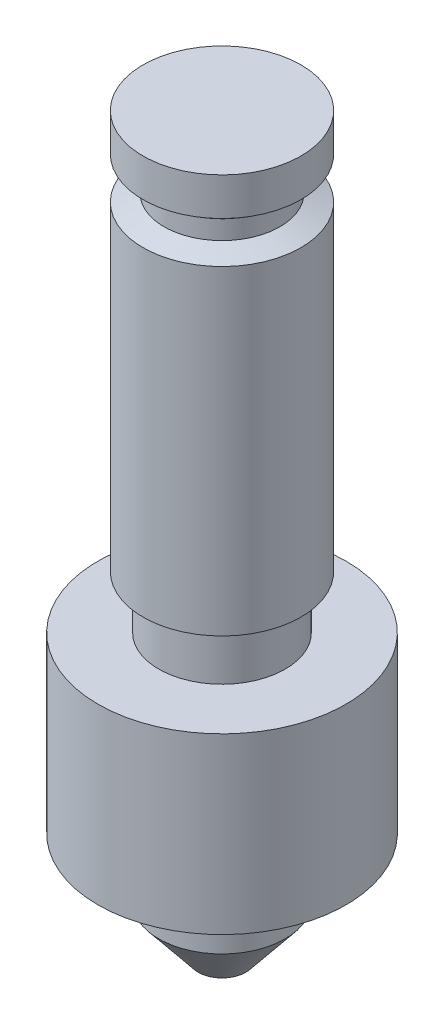
ISO-10303-21;
HEADER;
FILE_DESCRIPTION(('STEP AP214'),'2;1');
FILE_NAME('part.step','',(''),(''),'','','');
FILE_SCHEMA(('AUTOMOTIVE_DESIGN { 1 0 10303 214 1 1 1 1 }'));
ENDSEC;
DATA;
#1=APPLICATION_CONTEXT('core data for automotive mechanical design processes');
#2=APPLICATION_PROTOCOL_DEFINITION('international standard','automotive_design',2000,#1);
#3=PRODUCT_CONTEXT('',#1,'mechanical');
#4=PRODUCT('Part','Part','',(#3));
#5=PRODUCT_RELATED_PRODUCT_CATEGORY('part','',(#4));
#6=PRODUCT_DEFINITION_FORMATION('','',#4);
#7=PRODUCT_DEFINITION_CONTEXT('part definition',#1,'design');
#8=PRODUCT_DEFINITION('design','',#6,#7);
#9=PRODUCT_DEFINITION_SHAPE('','',#8);
#10=(LENGTH_UNIT() NAMED_UNIT(*) SI_UNIT(.MILLI.,.METRE.));
#11=(NAMED_UNIT(*) PLANE_ANGLE_UNIT() SI_UNIT($,.RADIAN.));
#12=(NAMED_UNIT(*) SI_UNIT($,.STERADIAN.) SOLID_ANGLE_UNIT());
#13=UNCERTAINTY_MEASURE_WITH_UNIT(LENGTH_MEASURE(1.E-05),#10,'distance_accuracy_value','');
#14=(GEOMETRIC_REPRESENTATION_CONTEXT(3) GLOBAL_UNCERTAINTY_ASSIGNED_CONTEXT((#13)) GLOBAL_UNIT_ASSIGNED_CONTEXT((#10,
#11,#12)) REPRESENTATION_CONTEXT('',''));
#15=CARTESIAN_POINT('',(0.,0.,0.));
#16=DIRECTION('',(0.,0.,1.));
#17=DIRECTION('',(1.,0.,0.));
#18=AXIS2_PLACEMENT_3D('',#15,#16,#17);
#19=CARTESIAN_POINT('',(0.,0.,0.));
#20=DIRECTION('',(0.,-1.,0.));
#21=DIRECTION('',(0.,0.,-1.));
#22=AXIS2_PLACEMENT_3D('',#19,#20,#21);
#23=PLANE('',#22);
#24=CARTESIAN_POINT('',(0.,0.,0.));
#25=DIRECTION('',(0.,-1.,0.));
#26=DIRECTION('',(0.,0.,-1.));
#27=AXIS2_PLACEMENT_3D('',#24,#25,#26);
#28=CIRCLE('',#27,7.96290000000001);
#29=CARTESIAN_POINT('',(0.,0.,-7.96290000000001));
#30=VERTEX_POINT('',#29);
#31=EDGE_CURVE('E10',#30,#30,#28,.T.);
#32=ORIENTED_EDGE('',*,*,#31,.F.);
#33=EDGE_LOOP('',(#32));
#34=FACE_BOUND('',#33,.T.);
#35=ADVANCED_FACE('F30',(#34),#23,.F.);
#36=CARTESIAN_POINT('',(0.,0.,0.));
#37=DIRECTION('',(0.,-1.,0.));
#38=DIRECTION('',(0.,0.,-1.));
#39=AXIS2_PLACEMENT_3D('',#36,#37,#38);
#40=CYLINDRICAL_SURFACE('',#39,7.9629);
#41=CARTESIAN_POINT('',(0.,-3.81,0.));
#42=DIRECTION('',(0.,-1.,0.));
#43=DIRECTION('',(0.,0.,-1.));
#44=AXIS2_PLACEMENT_3D('',#41,#42,#43);
#45=CIRCLE('',#44,7.9629);
#46=CARTESIAN_POINT('',(0.,-3.81,-7.9629));
#47=VERTEX_POINT('',#46);
#48=EDGE_CURVE('E36',#47,#47,#45,.T.);
#49=ORIENTED_EDGE('',*,*,#48,.F.);
#50=EDGE_LOOP('',(#49));
#51=FACE_BOUND('',#50,.T.);
#52=ORIENTED_EDGE('',*,*,#31,.T.);
#53=EDGE_LOOP('',(#52));
#54=FACE_BOUND('',#53,.T.);
#55=ADVANCED_FACE('F141',(#51,#54),#40,.T.);
#56=CARTESIAN_POINT('',(0.,-3.81,0.));
#57=DIRECTION('',(0.,1.,0.));
#58=DIRECTION('',(0.,0.,1.));
#59=AXIS2_PLACEMENT_3D('',#56,#57,#58);
#60=CONICAL_SURFACE('',#59,7.9629,0.947720392714103);
#61=CARTESIAN_POINT('',(0.,-5.334,0.));
#62=DIRECTION('',(0.,-1.,0.));
#63=DIRECTION('',(0.,0.,-1.));
#64=AXIS2_PLACEMENT_3D('',#61,#62,#63);
#65=CIRCLE('',#64,5.842);
#66=CARTESIAN_POINT('',(0.,-5.334,-5.842));
#67=VERTEX_POINT('',#66);
#68=EDGE_CURVE('E40',#67,#67,#65,.T.);
#69=ORIENTED_EDGE('',*,*,#68,.F.);
#70=EDGE_LOOP('',(#69));
#71=FACE_BOUND('',#70,.T.);
#72=ORIENTED_EDGE('',*,*,#48,.T.);
#73=EDGE_LOOP('',(#72));
#74=FACE_BOUND('',#73,.T.);
#75=ADVANCED_FACE('F136',(#71,#74),#60,.T.);
#76=CARTESIAN_POINT('',(0.,0.,0.));
#77=DIRECTION('',(0.,-1.,0.));
#78=DIRECTION('',(0.,0.,-1.));
#79=AXIS2_PLACEMENT_3D('',#76,#77,#78);
#80=CYLINDRICAL_SURFACE('',#79,5.842);
#81=CARTESIAN_POINT('',(0.,-7.239,0.));
#82=DIRECTION('',(0.,-1.,0.));
#83=DIRECTION('',(0.,0.,-1.));
#84=AXIS2_PLACEMENT_3D('',#81,#82,#83);
#85=CIRCLE('',#84,5.842);
#86=CARTESIAN_POINT('',(0.,-7.239,-5.842));
#87=VERTEX_POINT('',#86);
#88=EDGE_CURVE('E44',#87,#87,#85,.T.);
#89=ORIENTED_EDGE('',*,*,#88,.F.);
#90=EDGE_LOOP('',(#89));
#91=FACE_BOUND('',#90,.T.);
#92=ORIENTED_EDGE('',*,*,#68,.T.);
#93=EDGE_LOOP('',(#92));
#94=FACE_BOUND('',#93,.T.);
#95=ADVANCED_FACE('F130',(#91,#94),#80,.T.);
#96=CARTESIAN_POINT('',(0.,-7.239,0.));
#97=DIRECTION('',(0.,-1.,0.));
#98=DIRECTION('',(0.,0.,-1.));
#99=AXIS2_PLACEMENT_3D('',#96,#97,#98);
#100=CONICAL_SURFACE('',#99,5.842,1.22587701335956);
#101=CARTESIAN_POINT('',(0.,-8.001,0.));
#102=DIRECTION('',(0.,-1.,0.));
#103=DIRECTION('',(0.,0.,-1.));
#104=AXIS2_PLACEMENT_3D('',#101,#102,#103);
#105=CIRCLE('',#104,7.9629);
#106=CARTESIAN_POINT('',(0.,-8.001,-7.9629));
#107=VERTEX_POINT('',#106);
#108=EDGE_CURVE('E49',#107,#107,#105,.T.);
#109=ORIENTED_EDGE('',*,*,#108,.F.);
#110=EDGE_LOOP('',(#109));
#111=FACE_BOUND('',#110,.T.);
#112=ORIENTED_EDGE('',*,*,#88,.T.);
#113=EDGE_LOOP('',(#112));
#114=FACE_BOUND('',#113,.T.);
#115=ADVANCED_FACE('F124',(#111,#114),#100,.T.);
#116=CARTESIAN_POINT('',(0.,0.,0.));
#117=DIRECTION('',(0.,-1.,0.));
#118=DIRECTION('',(0.,0.,-1.));
#119=AXIS2_PLACEMENT_3D('',#116,#117,#118);
#120=CYLINDRICAL_SURFACE('',#119,7.9629);
#121=CARTESIAN_POINT('',(0.,-40.259,0.));
#122=DIRECTION('',(0.,-1.,0.));
#123=DIRECTION('',(0.,0.,-1.));
#124=AXIS2_PLACEMENT_3D('',#121,#122,#123);
#125=CIRCLE('',#124,7.9629);
#126=CARTESIAN_POINT('',(0.,-40.259,-7.9629));
#127=VERTEX_POINT('',#126);
#128=EDGE_CURVE('E52',#127,#127,#125,.T.);
#129=ORIENTED_EDGE('',*,*,#128,.F.);
#130=EDGE_LOOP('',(#129));
#131=FACE_BOUND('',#130,.T.);
#132=ORIENTED_EDGE('',*,*,#108,.T.);
#133=EDGE_LOOP('',(#132));
#134=FACE_BOUND('',#133,.T.);
#135=ADVANCED_FACE('F118',(#131,#134),#120,.T.);
#136=CARTESIAN_POINT('',(-7.9629,-40.259,0.));
#137=DIRECTION('',(0.,1.,0.));
#138=DIRECTION('',(0.,0.,1.));
#139=AXIS2_PLACEMENT_3D('',#136,#137,#138);
#140=PLANE('',#139);
#141=CARTESIAN_POINT('',(0.,-40.259,0.));
#142=DIRECTION('',(0.,-1.,0.));
#143=DIRECTION('',(0.,0.,-1.));
#144=AXIS2_PLACEMENT_3D('',#141,#142,#143);
#145=CIRCLE('',#144,6.37539999999999);
#146=CARTESIAN_POINT('',(0.,-40.259,-6.37539999999999));
#147=VERTEX_POINT('',#146);
#148=EDGE_CURVE('E55',#147,#147,#145,.T.);
#149=ORIENTED_EDGE('',*,*,#148,.F.);
#150=EDGE_LOOP('',(#149));
#151=FACE_BOUND('',#150,.T.);
#152=ORIENTED_EDGE('',*,*,#128,.T.);
#153=EDGE_LOOP('',(#152));
#154=FACE_BOUND('',#153,.T.);
#155=ADVANCED_FACE('F112',(#151,#154),#140,.F.);
#156=CARTESIAN_POINT('',(0.,0.,0.));
#157=DIRECTION('',(0.,-1.,0.));
#158=DIRECTION('',(0.,0.,-1.));
#159=AXIS2_PLACEMENT_3D('',#156,#157,#158);
#160=CYLINDRICAL_SURFACE('',#159,6.37539999999999);
#161=CARTESIAN_POINT('',(0.,-45.593,0.));
#162=DIRECTION('',(0.,-1.,0.));
#163=DIRECTION('',(0.,0.,-1.));
#164=AXIS2_PLACEMENT_3D('',#161,#162,#163);
#165=CIRCLE('',#164,6.37539999999999);
#166=CARTESIAN_POINT('',(0.,-45.593,-6.37539999999999));
#167=VERTEX_POINT('',#166);
#168=EDGE_CURVE('E58',#167,#167,#165,.T.);
#169=ORIENTED_EDGE('',*,*,#168,.F.);
#170=EDGE_LOOP('',(#169));
#171=FACE_BOUND('',#170,.T.);
#172=ORIENTED_EDGE('',*,*,#148,.T.);
#173=EDGE_LOOP('',(#172));
#174=FACE_BOUND('',#173,.T.);
#175=ADVANCED_FACE('F106',(#171,#174),#160,.T.);
#176=CARTESIAN_POINT('',(-6.37539999999999,-45.593,0.));
#177=DIRECTION('',(0.,-1.,0.));
#178=DIRECTION('',(0.,0.,-1.));
#179=AXIS2_PLACEMENT_3D('',#176,#177,#178);
#180=PLANE('',#179);
#181=CARTESIAN_POINT('',(0.,-45.593,0.));
#182=DIRECTION('',(0.,-1.,0.));
#183=DIRECTION('',(0.,0.,-1.));
#184=AXIS2_PLACEMENT_3D('',#181,#182,#183);
#185=CIRCLE('',#184,12.5);
#186=CARTESIAN_POINT('',(0.,-45.593,-12.5));
#187=VERTEX_POINT('',#186);
#188=EDGE_CURVE('E61',#187,#187,#185,.T.);
#189=ORIENTED_EDGE('',*,*,#188,.F.);
#190=EDGE_LOOP('',(#189));
#191=FACE_BOUND('',#190,.T.);
#192=ORIENTED_EDGE('',*,*,#168,.T.);
#193=EDGE_LOOP('',(#192));
#194=FACE_BOUND('',#193,.T.);
#195=ADVANCED_FACE('F100',(#191,#194),#180,.F.);
#196=CARTESIAN_POINT('',(0.,0.,0.));
#197=DIRECTION('',(0.,-1.,0.));
#198=DIRECTION('',(0.,0.,-1.));
#199=AXIS2_PLACEMENT_3D('',#196,#197,#198);
#200=CYLINDRICAL_SURFACE('',#199,12.5);
#201=CARTESIAN_POINT('',(0.,-63.119,0.));
#202=DIRECTION('',(0.,-1.,0.));
#203=DIRECTION('',(0.,0.,-1.));
#204=AXIS2_PLACEMENT_3D('',#201,#202,#203);
#205=CIRCLE('',#204,12.5);
#206=CARTESIAN_POINT('',(0.,-63.119,-12.5));
#207=VERTEX_POINT('',#206);
#208=EDGE_CURVE('E64',#207,#207,#205,.T.);
#209=ORIENTED_EDGE('',*,*,#208,.F.);
#210=EDGE_LOOP('',(#209));
#211=FACE_BOUND('',#210,.T.);
#212=ORIENTED_EDGE('',*,*,#188,.T.);
#213=EDGE_LOOP('',(#212));
#214=FACE_BOUND('',#213,.T.);
#215=ADVANCED_FACE('F94',(#211,#214),#200,.T.);
#216=CARTESIAN_POINT('',(-12.5,-63.119,0.));
#217=DIRECTION('',(0.,1.,0.));
#218=DIRECTION('',(0.,0.,1.));
#219=AXIS2_PLACEMENT_3D('',#216,#217,#218);
#220=PLANE('',#219);
#221=CARTESIAN_POINT('',(0.,-63.119,0.));
#222=DIRECTION('',(0.,-1.,0.));
#223=DIRECTION('',(0.,0.,-1.));
#224=AXIS2_PLACEMENT_3D('',#221,#222,#223);
#225=CIRCLE('',#224,6.37539999999999);
#226=CARTESIAN_POINT('',(0.,-63.119,-6.37539999999999));
#227=VERTEX_POINT('',#226);
#228=EDGE_CURVE('E67',#227,#227,#225,.T.);
#229=ORIENTED_EDGE('',*,*,#228,.F.);
#230=EDGE_LOOP('',(#229));
#231=FACE_BOUND('',#230,.T.);
#232=ORIENTED_EDGE('',*,*,#208,.T.);
#233=EDGE_LOOP('',(#232));
#234=FACE_BOUND('',#233,.T.);
#235=ADVANCED_FACE('F88',(#231,#234),#220,.F.);
#236=CARTESIAN_POINT('',(0.,0.,0.));
#237=DIRECTION('',(0.,-1.,0.));
#238=DIRECTION('',(0.,0.,-1.));
#239=AXIS2_PLACEMENT_3D('',#236,#237,#238);
#240=CYLINDRICAL_SURFACE('',#239,6.37539999999999);
#241=CARTESIAN_POINT('',(0.,-69.142247750506,0.));
#242=DIRECTION('',(0.,-1.,0.));
#243=DIRECTION('',(0.,0.,-1.));
#244=AXIS2_PLACEMENT_3D('',#241,#242,#243);
#245=CIRCLE('',#244,6.37539999999999);
#246=CARTESIAN_POINT('',(0.,-69.142247750506,-6.37539999999999));
#247=VERTEX_POINT('',#246);
#248=EDGE_CURVE('E70',#247,#247,#245,.T.);
#249=ORIENTED_EDGE('',*,*,#248,.F.);
#250=EDGE_LOOP('',(#249));
#251=FACE_BOUND('',#250,.T.);
#252=ORIENTED_EDGE('',*,*,#228,.T.);
#253=EDGE_LOOP('',(#252));
#254=FACE_BOUND('',#253,.T.);
#255=ADVANCED_FACE('F82',(#251,#254),#240,.T.);
#256=CARTESIAN_POINT('',(0.,-69.142247750506,0.));
#257=DIRECTION('',(0.,1.,0.));
#258=DIRECTION('',(0.,0.,1.));
#259=AXIS2_PLACEMENT_3D('',#256,#257,#258);
#260=CONICAL_SURFACE('',#259,6.37539999999999,0.68041348783825);
#261=CARTESIAN_POINT('',(0.,-74.041,0.));
#262=DIRECTION('',(0.,-1.,0.));
#263=DIRECTION('',(0.,0.,-1.));
#264=AXIS2_PLACEMENT_3D('',#261,#262,#263);
#265=CIRCLE('',#264,2.41061698375791);
#266=CARTESIAN_POINT('',(0.,-74.041,-2.41061698375791));
#267=VERTEX_POINT('',#266);
#268=EDGE_CURVE('E73',#267,#267,#265,.T.);
#269=ORIENTED_EDGE('',*,*,#268,.F.);
#270=EDGE_LOOP('',(#269));
#271=FACE_BOUND('',#270,.T.);
#272=ORIENTED_EDGE('',*,*,#248,.T.);
#273=EDGE_LOOP('',(#272));
#274=FACE_BOUND('',#273,.T.);
#275=ADVANCED_FACE('F79',(#271,#274),#260,.T.);
#276=CARTESIAN_POINT('',(-2.41061698375791,-74.041,0.));
#277=DIRECTION('',(0.,1.,0.));
#278=DIRECTION('',(0.,0.,1.));
#279=AXIS2_PLACEMENT_3D('',#276,#277,#278);
#280=PLANE('',#279);
#281=ORIENTED_EDGE('',*,*,#268,.T.);
#282=EDGE_LOOP('',(#281));
#283=FACE_BOUND('',#282,.T.);
#284=ADVANCED_FACE('F77',(#283),#280,.F.);
#285=CLOSED_SHELL('',(#35,#55,#75,#95,#115,#135,#155,#175,#195,#215,#235,#255,#275,#284));
#286=MANIFOLD_SOLID_BREP('B2',#285);
#287=ADVANCED_BREP_SHAPE_REPRESENTATION('',(#18,#286),#14);
#288=SHAPE_DEFINITION_REPRESENTATION(#9,#287);
ENDSEC;
END-ISO-10303-21;
